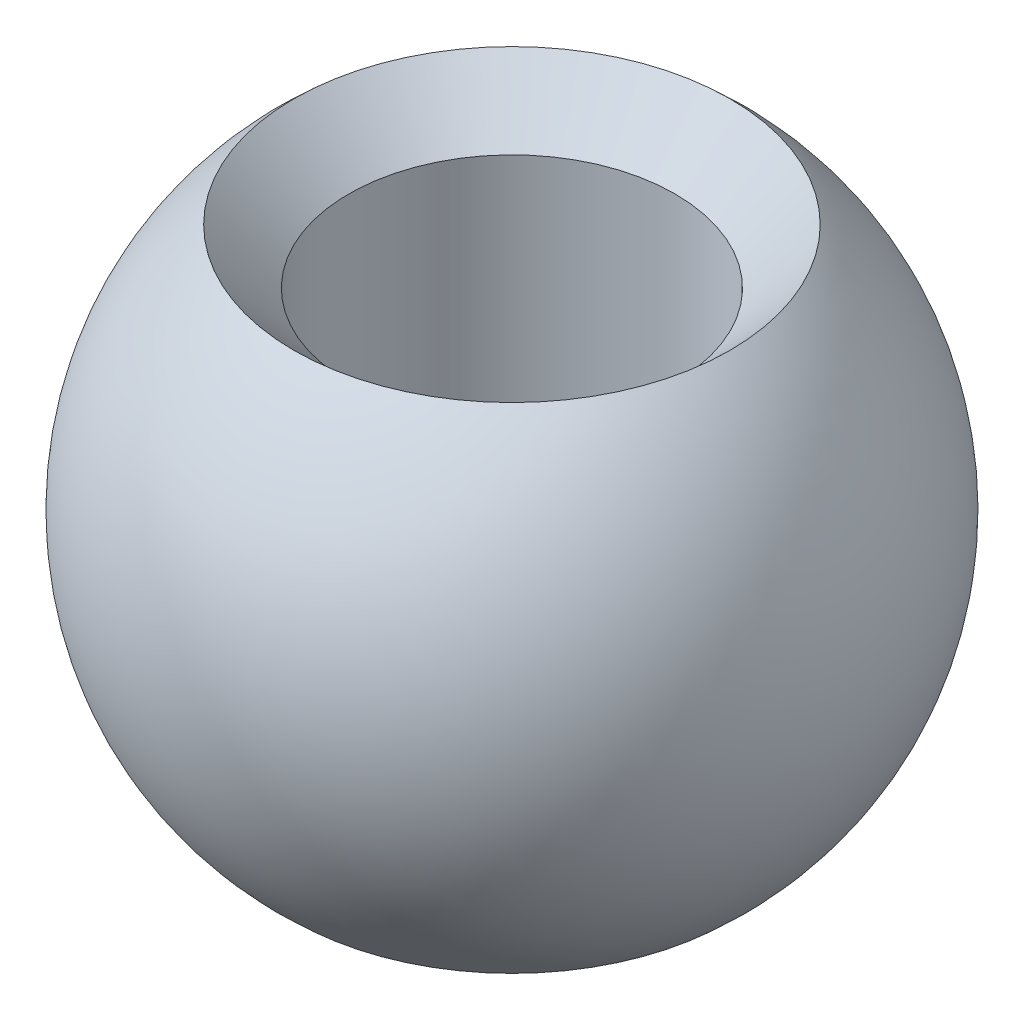
ISO-10303-21;
HEADER;
FILE_DESCRIPTION(('STEP AP214'),'2;1');
FILE_NAME('part.step','',(''),(''),'','','');
FILE_SCHEMA(('AUTOMOTIVE_DESIGN { 1 0 10303 214 1 1 1 1 }'));
ENDSEC;
DATA;
#1=APPLICATION_CONTEXT('core data for automotive mechanical design processes');
#2=APPLICATION_PROTOCOL_DEFINITION('international standard','automotive_design',2000,#1);
#3=PRODUCT_CONTEXT('',#1,'mechanical');
#4=PRODUCT('Part','Part','',(#3));
#5=PRODUCT_RELATED_PRODUCT_CATEGORY('part','',(#4));
#6=PRODUCT_DEFINITION_FORMATION('','',#4);
#7=PRODUCT_DEFINITION_CONTEXT('part definition',#1,'design');
#8=PRODUCT_DEFINITION('design','',#6,#7);
#9=PRODUCT_DEFINITION_SHAPE('','',#8);
#10=(LENGTH_UNIT() NAMED_UNIT(*) SI_UNIT(.MILLI.,.METRE.));
#11=(NAMED_UNIT(*) PLANE_ANGLE_UNIT() SI_UNIT($,.RADIAN.));
#12=(NAMED_UNIT(*) SI_UNIT($,.STERADIAN.) SOLID_ANGLE_UNIT());
#13=UNCERTAINTY_MEASURE_WITH_UNIT(LENGTH_MEASURE(1.E-05),#10,'distance_accuracy_value','');
#14=(GEOMETRIC_REPRESENTATION_CONTEXT(3) GLOBAL_UNCERTAINTY_ASSIGNED_CONTEXT((#13)) GLOBAL_UNIT_ASSIGNED_CONTEXT((#10,
#11,#12)) REPRESENTATION_CONTEXT('',''));
#15=CARTESIAN_POINT('',(0.,0.,0.));
#16=DIRECTION('',(0.,0.,1.));
#17=DIRECTION('',(1.,0.,0.));
#18=AXIS2_PLACEMENT_3D('',#15,#16,#17);
#19=CARTESIAN_POINT('',(0.,4.5,0.));
#20=DIRECTION('',(0.,1.,0.));
#21=DIRECTION('',(0.,0.,1.));
#22=AXIS2_PLACEMENT_3D('',#19,#20,#21);
#23=CONICAL_SURFACE('',#22,3.96862696659689,0.785398163397448);
#24=CARTESIAN_POINT('',(0.,3.5,0.));
#25=DIRECTION('',(0.,-1.,0.));
#26=DIRECTION('',(0.,0.,-1.));
#27=AXIS2_PLACEMENT_3D('',#24,#25,#26);
#28=CIRCLE('',#27,2.96862696659689);
#29=CARTESIAN_POINT('',(0.,3.5,-2.96862696659689));
#30=VERTEX_POINT('',#29);
#31=EDGE_CURVE('E46',#30,#30,#28,.T.);
#32=ORIENTED_EDGE('',*,*,#31,.T.);
#33=EDGE_LOOP('',(#32));
#34=FACE_BOUND('',#33,.T.);
#35=CARTESIAN_POINT('',(0.,4.5,0.));
#36=DIRECTION('',(0.,-1.,0.));
#37=DIRECTION('',(0.,0.,-1.));
#38=AXIS2_PLACEMENT_3D('',#35,#36,#37);
#39=CIRCLE('',#38,3.96862696659689);
#40=CARTESIAN_POINT('',(0.,4.5,-3.96862696659689));
#41=VERTEX_POINT('',#40);
#42=EDGE_CURVE('E10',#41,#41,#39,.T.);
#43=ORIENTED_EDGE('',*,*,#42,.F.);
#44=EDGE_LOOP('',(#43));
#45=FACE_BOUND('',#44,.T.);
#46=ADVANCED_FACE('F32',(#34,#45),#23,.F.);
#47=CARTESIAN_POINT('',(0.,0.,0.));
#48=DIRECTION('',(0.,-1.,0.));
#49=DIRECTION('',(-1.,0.,0.));
#50=AXIS2_PLACEMENT_3D('',#47,#48,#49);
#51=SPHERICAL_SURFACE('',#50,6.);
#52=CARTESIAN_POINT('',(0.,-4.5,0.));
#53=DIRECTION('',(0.,-1.,0.));
#54=DIRECTION('',(0.,0.,-1.));
#55=AXIS2_PLACEMENT_3D('',#52,#53,#54);
#56=CIRCLE('',#55,3.96862696659689);
#57=CARTESIAN_POINT('',(0.,-4.5,-3.96862696659689));
#58=VERTEX_POINT('',#57);
#59=EDGE_CURVE('E38',#58,#58,#56,.T.);
#60=ORIENTED_EDGE('',*,*,#59,.F.);
#61=EDGE_LOOP('',(#60));
#62=FACE_BOUND('',#61,.T.);
#63=ORIENTED_EDGE('',*,*,#42,.T.);
#64=EDGE_LOOP('',(#63));
#65=FACE_BOUND('',#64,.T.);
#66=ADVANCED_FACE('F62',(#62,#65),#51,.T.);
#67=CARTESIAN_POINT('',(0.,-4.5,0.));
#68=DIRECTION('',(0.,1.,0.));
#69=DIRECTION('',(0.,0.,1.));
#70=AXIS2_PLACEMENT_3D('',#67,#68,#69);
#71=PLANE('',#70);
#72=CARTESIAN_POINT('',(0.,-4.5,0.));
#73=DIRECTION('',(0.,-1.,0.));
#74=DIRECTION('',(0.,0.,-1.));
#75=AXIS2_PLACEMENT_3D('',#72,#73,#74);
#76=CIRCLE('',#75,2.96862696659686);
#77=CARTESIAN_POINT('',(0.,-4.5,-2.96862696659686));
#78=VERTEX_POINT('',#77);
#79=EDGE_CURVE('E42',#78,#78,#76,.T.);
#80=ORIENTED_EDGE('',*,*,#79,.F.);
#81=EDGE_LOOP('',(#80));
#82=FACE_BOUND('',#81,.T.);
#83=ORIENTED_EDGE('',*,*,#59,.T.);
#84=EDGE_LOOP('',(#83));
#85=FACE_BOUND('',#84,.T.);
#86=ADVANCED_FACE('F56',(#82,#85),#71,.F.);
#87=CARTESIAN_POINT('',(0.,-8.40134775130321,0.));
#88=DIRECTION('',(0.,-1.,0.));
#89=DIRECTION('',(0.,0.,-1.));
#90=AXIS2_PLACEMENT_3D('',#87,#88,#89);
#91=CYLINDRICAL_SURFACE('',#90,2.96862696659688);
#92=ORIENTED_EDGE('',*,*,#79,.T.);
#93=EDGE_LOOP('',(#92));
#94=FACE_BOUND('',#93,.T.);
#95=ORIENTED_EDGE('',*,*,#31,.F.);
#96=EDGE_LOOP('',(#95));
#97=FACE_BOUND('',#96,.T.);
#98=ADVANCED_FACE('F54',(#94,#97),#91,.F.);
#99=CLOSED_SHELL('',(#46,#66,#86,#98));
#100=MANIFOLD_SOLID_BREP('B2',#99);
#101=ADVANCED_BREP_SHAPE_REPRESENTATION('',(#18,#100),#14);
#102=SHAPE_DEFINITION_REPRESENTATION(#9,#101);
ENDSEC;
END-ISO-10303-21;
